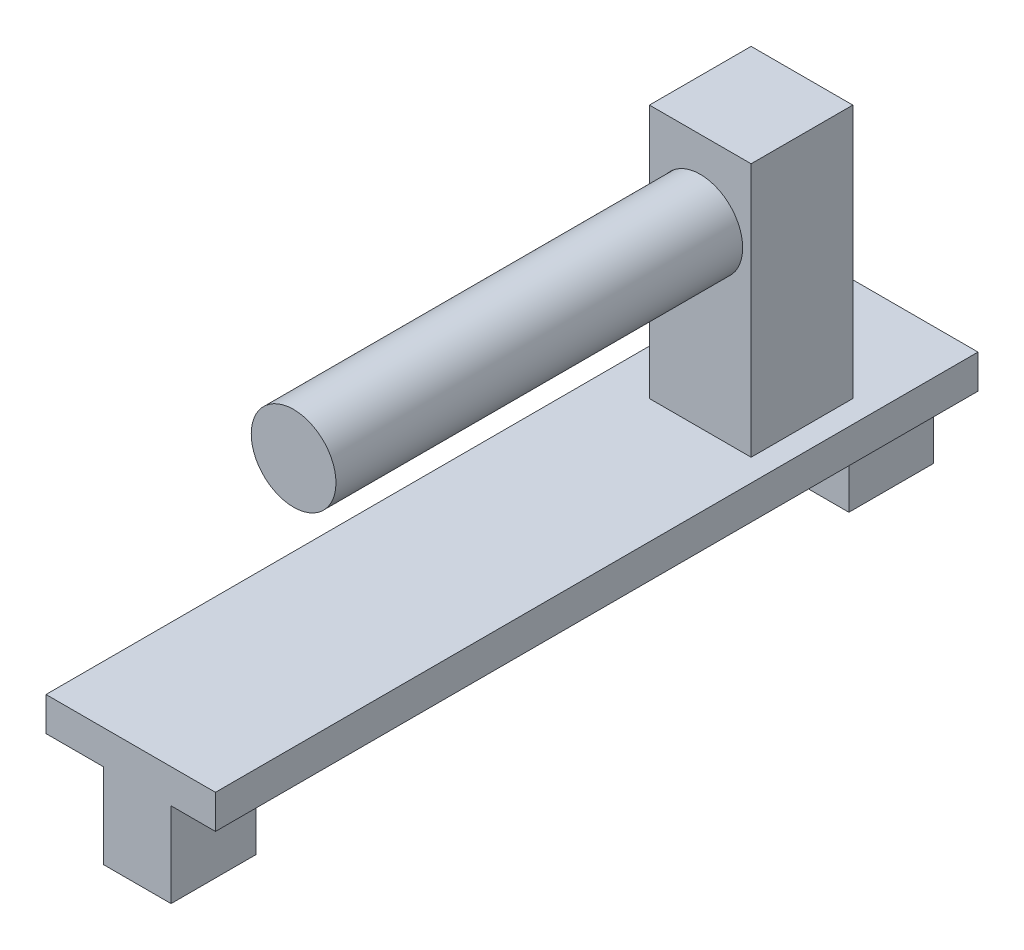
ISO-10303-21;
HEADER;
FILE_DESCRIPTION(('STEP AP214'),'2;1');
FILE_NAME('part.step','',(''),(''),'','','');
FILE_SCHEMA(('AUTOMOTIVE_DESIGN { 1 0 10303 214 1 1 1 1 }'));
ENDSEC;
DATA;
#1=APPLICATION_CONTEXT('core data for automotive mechanical design processes');
#2=APPLICATION_PROTOCOL_DEFINITION('international standard','automotive_design',2000,#1);
#3=PRODUCT_CONTEXT('',#1,'mechanical');
#4=PRODUCT('Part','Part','',(#3));
#5=PRODUCT_RELATED_PRODUCT_CATEGORY('part','',(#4));
#6=PRODUCT_DEFINITION_FORMATION('','',#4);
#7=PRODUCT_DEFINITION_CONTEXT('part definition',#1,'design');
#8=PRODUCT_DEFINITION('design','',#6,#7);
#9=PRODUCT_DEFINITION_SHAPE('','',#8);
#10=(LENGTH_UNIT() NAMED_UNIT(*) SI_UNIT(.MILLI.,.METRE.));
#11=(NAMED_UNIT(*) PLANE_ANGLE_UNIT() SI_UNIT($,.RADIAN.));
#12=(NAMED_UNIT(*) SI_UNIT($,.STERADIAN.) SOLID_ANGLE_UNIT());
#13=UNCERTAINTY_MEASURE_WITH_UNIT(LENGTH_MEASURE(1.E-05),#10,'distance_accuracy_value','');
#14=(GEOMETRIC_REPRESENTATION_CONTEXT(3) GLOBAL_UNCERTAINTY_ASSIGNED_CONTEXT((#13)) GLOBAL_UNIT_ASSIGNED_CONTEXT((#10,
#11,#12)) REPRESENTATION_CONTEXT('',''));
#15=CARTESIAN_POINT('',(0.,0.,0.));
#16=DIRECTION('',(0.,0.,1.));
#17=DIRECTION('',(1.,0.,0.));
#18=AXIS2_PLACEMENT_3D('',#15,#16,#17);
#19=CARTESIAN_POINT('',(-3.,15.,3.));
#20=DIRECTION('',(0.,0.,-1.));
#21=DIRECTION('',(-1.,0.,0.));
#22=AXIS2_PLACEMENT_3D('',#19,#20,#21);
#23=PLANE('',#22);
#24=DIRECTION('',(1.,0.,0.));
#25=VECTOR('',#24,1.);
#26=CARTESIAN_POINT('',(-3.,0.,3.));
#27=LINE('',#26,#25);
#28=CARTESIAN_POINT('',(-3.,0.,3.));
#29=VERTEX_POINT('',#28);
#30=CARTESIAN_POINT('',(3.,0.,3.));
#31=VERTEX_POINT('',#30);
#32=EDGE_CURVE('E350',#29,#31,#27,.T.);
#33=ORIENTED_EDGE('',*,*,#32,.T.);
#34=DIRECTION('',(0.,-1.,0.));
#35=VECTOR('',#34,1.);
#36=CARTESIAN_POINT('',(3.,15.,3.));
#37=LINE('',#36,#35);
#38=CARTESIAN_POINT('',(3.,15.,3.));
#39=VERTEX_POINT('',#38);
#40=EDGE_CURVE('E356',#39,#31,#37,.T.);
#41=ORIENTED_EDGE('',*,*,#40,.F.);
#42=DIRECTION('',(1.,0.,0.));
#43=VECTOR('',#42,1.);
#44=CARTESIAN_POINT('',(-3.,15.,3.));
#45=LINE('',#44,#43);
#46=CARTESIAN_POINT('',(-3.,15.,3.));
#47=VERTEX_POINT('',#46);
#48=EDGE_CURVE('E354',#47,#39,#45,.T.);
#49=ORIENTED_EDGE('',*,*,#48,.F.);
#50=DIRECTION('',(0.,-1.,0.));
#51=VECTOR('',#50,1.);
#52=CARTESIAN_POINT('',(-3.,15.,3.));
#53=LINE('',#52,#51);
#54=EDGE_CURVE('E369',#47,#29,#53,.T.);
#55=ORIENTED_EDGE('',*,*,#54,.T.);
#56=EDGE_LOOP('',(#33,#41,#49,#55));
#57=FACE_BOUND('',#56,.T.);
#58=CARTESIAN_POINT('',(0.,10.4452328602633,3.));
#59=DIRECTION('',(0.,0.,-1.));
#60=DIRECTION('',(-1.,0.,0.));
#61=AXIS2_PLACEMENT_3D('',#58,#59,#60);
#62=CIRCLE('',#61,2.5);
#63=CARTESIAN_POINT('',(-2.49998592310197,10.4536223949339,3.));
#64=VERTEX_POINT('',#63);
#65=CARTESIAN_POINT('',(2.49998592310197,10.4536223949339,3.));
#66=VERTEX_POINT('',#65);
#67=EDGE_CURVE('E198',#64,#66,#62,.F.);
#68=ORIENTED_EDGE('',*,*,#67,.F.);
#69=CARTESIAN_POINT('',(0.,10.4620119296044,3.));
#70=DIRECTION('',(0.,0.,1.));
#71=DIRECTION('',(1.,0.,0.));
#72=AXIS2_PLACEMENT_3D('',#69,#70,#71);
#73=CIRCLE('',#72,2.5);
#74=EDGE_CURVE('E197',#66,#64,#73,.T.);
#75=ORIENTED_EDGE('',*,*,#74,.F.);
#76=EDGE_LOOP('',(#68,#75));
#77=FACE_BOUND('',#76,.T.);
#78=ADVANCED_FACE('F33',(#57,#77),#23,.F.);
#79=CARTESIAN_POINT('',(0.,10.4620119296044,2.));
#80=DIRECTION('',(0.,0.,1.));
#81=DIRECTION('',(1.,0.,0.));
#82=AXIS2_PLACEMENT_3D('',#79,#80,#81);
#83=CYLINDRICAL_SURFACE('',#82,2.5);
#84=DIRECTION('',(0.,0.,-1.));
#85=VECTOR('',#84,1.);
#86=CARTESIAN_POINT('',(2.49998592310197,10.4536223949339,14.5));
#87=LINE('',#86,#85);
#88=CARTESIAN_POINT('',(2.49998592310197,10.4536223949339,2.));
#89=VERTEX_POINT('',#88);
#90=EDGE_CURVE('E50',#66,#89,#87,.T.);
#91=ORIENTED_EDGE('',*,*,#90,.F.);
#92=ORIENTED_EDGE('',*,*,#74,.T.);
#93=DIRECTION('',(0.,0.,-1.));
#94=VECTOR('',#93,1.);
#95=CARTESIAN_POINT('',(-2.49998592310197,10.4536223949339,14.5));
#96=LINE('',#95,#94);
#97=CARTESIAN_POINT('',(-2.49998592310197,10.4536223949339,2.));
#98=VERTEX_POINT('',#97);
#99=EDGE_CURVE('E185',#98,#64,#96,.F.);
#100=ORIENTED_EDGE('',*,*,#99,.F.);
#101=CARTESIAN_POINT('',(0.,10.4620119296044,2.));
#102=DIRECTION('',(0.,0.,1.));
#103=DIRECTION('',(1.,0.,0.));
#104=AXIS2_PLACEMENT_3D('',#101,#102,#103);
#105=CIRCLE('',#104,2.5);
#106=EDGE_CURVE('E195',#89,#98,#105,.T.);
#107=ORIENTED_EDGE('',*,*,#106,.F.);
#108=EDGE_LOOP('',(#91,#92,#100,#107));
#109=FACE_BOUND('',#108,.T.);
#110=ADVANCED_FACE('F194',(#109),#83,.F.);
#111=CARTESIAN_POINT('',(0.,10.4620119296044,2.));
#112=DIRECTION('',(0.,0.,1.));
#113=DIRECTION('',(1.,0.,0.));
#114=AXIS2_PLACEMENT_3D('',#111,#112,#113);
#115=PLANE('',#114);
#116=ORIENTED_EDGE('',*,*,#106,.T.);
#117=CARTESIAN_POINT('',(0.,10.4452328602633,2.));
#118=DIRECTION('',(0.,0.,1.));
#119=DIRECTION('',(1.,0.,0.));
#120=AXIS2_PLACEMENT_3D('',#117,#118,#119);
#121=CIRCLE('',#120,2.5);
#122=EDGE_CURVE('E182',#89,#98,#121,.T.);
#123=ORIENTED_EDGE('',*,*,#122,.F.);
#124=EDGE_LOOP('',(#116,#123));
#125=FACE_BOUND('',#124,.T.);
#126=ADVANCED_FACE('F200',(#125),#115,.T.);
#127=CARTESIAN_POINT('',(0.,0.,-7.0712800267579));
#128=DIRECTION('',(0.,0.,-1.));
#129=DIRECTION('',(-1.,0.,0.));
#130=AXIS2_PLACEMENT_3D('',#127,#128,#129);
#131=PLANE('',#130);
#132=DIRECTION('',(-1.,0.,0.));
#133=VECTOR('',#132,1.);
#134=CARTESIAN_POINT('',(1.69782054790448,-4.,-7.0712800267579));
#135=LINE('',#134,#133);
#136=CARTESIAN_POINT('',(1.69782054790448,-4.,-7.0712800267579));
#137=VERTEX_POINT('',#136);
#138=CARTESIAN_POINT('',(-2.30217945209552,-4.,-7.0712800267579));
#139=VERTEX_POINT('',#138);
#140=EDGE_CURVE('E201',#137,#139,#135,.T.);
#141=ORIENTED_EDGE('',*,*,#140,.F.);
#142=DIRECTION('',(0.,-1.,0.));
#143=VECTOR('',#142,1.);
#144=CARTESIAN_POINT('',(1.69782054790448,-2.,-7.0712800267579));
#145=LINE('',#144,#143);
#146=CARTESIAN_POINT('',(1.69782054790448,-2.,-7.0712800267579));
#147=VERTEX_POINT('',#146);
#148=EDGE_CURVE('E242',#147,#137,#145,.T.);
#149=ORIENTED_EDGE('',*,*,#148,.F.);
#150=DIRECTION('',(1.,0.,0.));
#151=VECTOR('',#150,1.);
#152=CARTESIAN_POINT('',(1.69782054790448,-2.,-7.0712800267579));
#153=LINE('',#152,#151);
#154=CARTESIAN_POINT('',(-2.30217945209552,-2.,-7.0712800267579));
#155=VERTEX_POINT('',#154);
#156=EDGE_CURVE('E248',#155,#147,#153,.T.);
#157=ORIENTED_EDGE('',*,*,#156,.F.);
#158=DIRECTION('',(0.,1.,0.));
#159=VECTOR('',#158,1.);
#160=CARTESIAN_POINT('',(-2.30217945209552,-2.,-7.0712800267579));
#161=LINE('',#160,#159);
#162=EDGE_CURVE('E245',#139,#155,#161,.T.);
#163=ORIENTED_EDGE('',*,*,#162,.F.);
#164=EDGE_LOOP('',(#141,#149,#157,#163));
#165=FACE_BOUND('',#164,.T.);
#166=ADVANCED_FACE('F418',(#165),#131,.F.);
#167=CARTESIAN_POINT('',(0.,0.,33.9287199732421));
#168=DIRECTION('',(0.,0.,1.));
#169=DIRECTION('',(1.,0.,0.));
#170=AXIS2_PLACEMENT_3D('',#167,#168,#169);
#171=PLANE('',#170);
#172=DIRECTION('',(1.,0.,0.));
#173=VECTOR('',#172,1.);
#174=CARTESIAN_POINT('',(1.69782054790449,-4.,33.9287199732421));
#175=LINE('',#174,#173);
#176=CARTESIAN_POINT('',(-2.30217945209552,-4.,33.9287199732421));
#177=VERTEX_POINT('',#176);
#178=CARTESIAN_POINT('',(1.69782054790449,-4.,33.9287199732421));
#179=VERTEX_POINT('',#178);
#180=EDGE_CURVE('E58',#177,#179,#175,.T.);
#181=ORIENTED_EDGE('',*,*,#180,.F.);
#182=DIRECTION('',(0.,-1.,0.));
#183=VECTOR('',#182,1.);
#184=CARTESIAN_POINT('',(-2.30217945209552,-2.,33.9287199732421));
#185=LINE('',#184,#183);
#186=CARTESIAN_POINT('',(-2.30217945209552,-2.,33.9287199732421));
#187=VERTEX_POINT('',#186);
#188=EDGE_CURVE('E268',#187,#177,#185,.T.);
#189=ORIENTED_EDGE('',*,*,#188,.F.);
#190=DIRECTION('',(-1.,0.,0.));
#191=VECTOR('',#190,1.);
#192=CARTESIAN_POINT('',(-2.30217945209552,-2.,33.9287199732421));
#193=LINE('',#192,#191);
#194=CARTESIAN_POINT('',(1.69782054790448,-2.,33.9287199732421));
#195=VERTEX_POINT('',#194);
#196=EDGE_CURVE('E273',#195,#187,#193,.T.);
#197=ORIENTED_EDGE('',*,*,#196,.F.);
#198=DIRECTION('',(0.,1.,0.));
#199=VECTOR('',#198,1.);
#200=CARTESIAN_POINT('',(1.69782054790448,-2.,33.9287199732421));
#201=LINE('',#200,#199);
#202=EDGE_CURVE('E270',#179,#195,#201,.T.);
#203=ORIENTED_EDGE('',*,*,#202,.F.);
#204=EDGE_LOOP('',(#181,#189,#197,#203));
#205=FACE_BOUND('',#204,.T.);
#206=ADVANCED_FACE('F414',(#205),#171,.F.);
#207=CARTESIAN_POINT('',(3.,15.,3.));
#208=DIRECTION('',(-1.,0.,0.));
#209=DIRECTION('',(0.,0.,1.));
#210=AXIS2_PLACEMENT_3D('',#207,#208,#209);
#211=PLANE('',#210);
#212=DIRECTION('',(0.,0.,-1.));
#213=VECTOR('',#212,1.);
#214=CARTESIAN_POINT('',(3.,0.,3.));
#215=LINE('',#214,#213);
#216=CARTESIAN_POINT('',(3.,0.,-3.));
#217=VERTEX_POINT('',#216);
#218=EDGE_CURVE('E340',#31,#217,#215,.T.);
#219=ORIENTED_EDGE('',*,*,#218,.T.);
#220=DIRECTION('',(0.,-1.,0.));
#221=VECTOR('',#220,1.);
#222=CARTESIAN_POINT('',(3.,15.,-3.));
#223=LINE('',#222,#221);
#224=CARTESIAN_POINT('',(3.,15.,-3.));
#225=VERTEX_POINT('',#224);
#226=EDGE_CURVE('E11',#225,#217,#223,.T.);
#227=ORIENTED_EDGE('',*,*,#226,.F.);
#228=DIRECTION('',(0.,0.,-1.));
#229=VECTOR('',#228,1.);
#230=CARTESIAN_POINT('',(3.,15.,3.));
#231=LINE('',#230,#229);
#232=EDGE_CURVE('E346',#39,#225,#231,.T.);
#233=ORIENTED_EDGE('',*,*,#232,.F.);
#234=ORIENTED_EDGE('',*,*,#40,.T.);
#235=EDGE_LOOP('',(#219,#227,#233,#234));
#236=FACE_BOUND('',#235,.T.);
#237=ADVANCED_FACE('F35',(#236),#211,.F.);
#238=CARTESIAN_POINT('',(-3.,15.,-3.));
#239=DIRECTION('',(0.,0.,1.));
#240=DIRECTION('',(1.,0.,0.));
#241=AXIS2_PLACEMENT_3D('',#238,#239,#240);
#242=PLANE('',#241);
#243=DIRECTION('',(-1.,0.,0.));
#244=VECTOR('',#243,1.);
#245=CARTESIAN_POINT('',(-3.,0.,-3.));
#246=LINE('',#245,#244);
#247=CARTESIAN_POINT('',(-3.,0.,-3.));
#248=VERTEX_POINT('',#247);
#249=EDGE_CURVE('E359',#217,#248,#246,.T.);
#250=ORIENTED_EDGE('',*,*,#249,.T.);
#251=DIRECTION('',(0.,-1.,0.));
#252=VECTOR('',#251,1.);
#253=CARTESIAN_POINT('',(-3.,15.,-3.));
#254=LINE('',#253,#252);
#255=CARTESIAN_POINT('',(-3.,15.,-3.));
#256=VERTEX_POINT('',#255);
#257=EDGE_CURVE('E42',#256,#248,#254,.T.);
#258=ORIENTED_EDGE('',*,*,#257,.F.);
#259=DIRECTION('',(-1.,0.,0.));
#260=VECTOR('',#259,1.);
#261=CARTESIAN_POINT('',(-3.,15.,-3.));
#262=LINE('',#261,#260);
#263=EDGE_CURVE('E349',#225,#256,#262,.T.);
#264=ORIENTED_EDGE('',*,*,#263,.F.);
#265=ORIENTED_EDGE('',*,*,#226,.T.);
#266=EDGE_LOOP('',(#250,#258,#264,#265));
#267=FACE_BOUND('',#266,.T.);
#268=ADVANCED_FACE('F379',(#267),#242,.F.);
#269=CARTESIAN_POINT('',(-3.,15.,3.));
#270=DIRECTION('',(1.,0.,0.));
#271=DIRECTION('',(0.,0.,-1.));
#272=AXIS2_PLACEMENT_3D('',#269,#270,#271);
#273=PLANE('',#272);
#274=DIRECTION('',(0.,0.,1.));
#275=VECTOR('',#274,1.);
#276=CARTESIAN_POINT('',(-3.,0.,3.));
#277=LINE('',#276,#275);
#278=EDGE_CURVE('E362',#248,#29,#277,.T.);
#279=ORIENTED_EDGE('',*,*,#278,.T.);
#280=ORIENTED_EDGE('',*,*,#54,.F.);
#281=DIRECTION('',(0.,0.,1.));
#282=VECTOR('',#281,1.);
#283=CARTESIAN_POINT('',(-3.,15.,3.));
#284=LINE('',#283,#282);
#285=EDGE_CURVE('E352',#256,#47,#284,.T.);
#286=ORIENTED_EDGE('',*,*,#285,.F.);
#287=ORIENTED_EDGE('',*,*,#257,.T.);
#288=EDGE_LOOP('',(#279,#280,#286,#287));
#289=FACE_BOUND('',#288,.T.);
#290=ADVANCED_FACE('F376',(#289),#273,.F.);
#291=CARTESIAN_POINT('',(0.,15.,0.));
#292=DIRECTION('',(0.,-1.,0.));
#293=DIRECTION('',(0.,0.,-1.));
#294=AXIS2_PLACEMENT_3D('',#291,#292,#293);
#295=PLANE('',#294);
#296=ORIENTED_EDGE('',*,*,#232,.T.);
#297=ORIENTED_EDGE('',*,*,#263,.T.);
#298=ORIENTED_EDGE('',*,*,#285,.T.);
#299=ORIENTED_EDGE('',*,*,#48,.T.);
#300=EDGE_LOOP('',(#296,#297,#298,#299));
#301=FACE_BOUND('',#300,.T.);
#302=ADVANCED_FACE('F390',(#301),#295,.F.);
#303=CARTESIAN_POINT('',(0.,0.,0.));
#304=DIRECTION('',(0.,-1.,0.));
#305=DIRECTION('',(0.,0.,-1.));
#306=AXIS2_PLACEMENT_3D('',#303,#304,#305);
#307=PLANE('',#306);
#308=DIRECTION('',(0.,0.,-1.));
#309=VECTOR('',#308,1.);
#310=CARTESIAN_POINT('',(4.31759311067933,0.,-9.0712800267579));
#311=LINE('',#310,#309);
#312=CARTESIAN_POINT('',(4.31759311067934,0.,35.9287199732421));
#313=VERTEX_POINT('',#312);
#314=CARTESIAN_POINT('',(4.31759311067933,0.,-9.0712800267579));
#315=VERTEX_POINT('',#314);
#316=EDGE_CURVE('E289',#313,#315,#311,.T.);
#317=ORIENTED_EDGE('',*,*,#316,.T.);
#318=DIRECTION('',(-1.,0.,0.));
#319=VECTOR('',#318,1.);
#320=CARTESIAN_POINT('',(4.31759311067933,0.,-9.0712800267579));
#321=LINE('',#320,#319);
#322=CARTESIAN_POINT('',(-5.68240688932066,0.,-9.0712800267579));
#323=VERTEX_POINT('',#322);
#324=EDGE_CURVE('E329',#315,#323,#321,.T.);
#325=ORIENTED_EDGE('',*,*,#324,.T.);
#326=DIRECTION('',(0.,0.,1.));
#327=VECTOR('',#326,1.);
#328=CARTESIAN_POINT('',(-5.68240688932066,0.,-9.0712800267579));
#329=LINE('',#328,#327);
#330=CARTESIAN_POINT('',(-5.68240688932066,0.,35.9287199732421));
#331=VERTEX_POINT('',#330);
#332=EDGE_CURVE('E332',#323,#331,#329,.T.);
#333=ORIENTED_EDGE('',*,*,#332,.T.);
#334=DIRECTION('',(1.,0.,0.));
#335=VECTOR('',#334,1.);
#336=CARTESIAN_POINT('',(4.31759311067934,0.,35.9287199732421));
#337=LINE('',#336,#335);
#338=EDGE_CURVE('E335',#331,#313,#337,.T.);
#339=ORIENTED_EDGE('',*,*,#338,.T.);
#340=EDGE_LOOP('',(#317,#325,#333,#339));
#341=FACE_BOUND('',#340,.T.);
#342=ORIENTED_EDGE('',*,*,#249,.F.);
#343=ORIENTED_EDGE('',*,*,#218,.F.);
#344=ORIENTED_EDGE('',*,*,#32,.F.);
#345=ORIENTED_EDGE('',*,*,#278,.F.);
#346=EDGE_LOOP('',(#342,#343,#344,#345));
#347=FACE_BOUND('',#346,.T.);
#348=ADVANCED_FACE('F382',(#341,#347),#307,.F.);
#349=CARTESIAN_POINT('',(4.31759311067933,-2.,-9.0712800267579));
#350=DIRECTION('',(1.,0.,0.));
#351=DIRECTION('',(0.,0.,-1.));
#352=AXIS2_PLACEMENT_3D('',#349,#350,#351);
#353=PLANE('',#352);
#354=ORIENTED_EDGE('',*,*,#316,.F.);
#355=DIRECTION('',(0.,1.,0.));
#356=VECTOR('',#355,1.);
#357=CARTESIAN_POINT('',(4.31759311067934,-2.,35.9287199732421));
#358=LINE('',#357,#356);
#359=CARTESIAN_POINT('',(4.31759311067934,-2.,35.9287199732421));
#360=VERTEX_POINT('',#359);
#361=EDGE_CURVE('E338',#360,#313,#358,.T.);
#362=ORIENTED_EDGE('',*,*,#361,.F.);
#363=DIRECTION('',(0.,0.,-1.));
#364=VECTOR('',#363,1.);
#365=CARTESIAN_POINT('',(4.31759311067933,-2.,-9.0712800267579));
#366=LINE('',#365,#364);
#367=CARTESIAN_POINT('',(4.31759311067933,-2.,-9.0712800267579));
#368=VERTEX_POINT('',#367);
#369=EDGE_CURVE('E312',#360,#368,#366,.T.);
#370=ORIENTED_EDGE('',*,*,#369,.T.);
#371=DIRECTION('',(0.,1.,0.));
#372=VECTOR('',#371,1.);
#373=CARTESIAN_POINT('',(4.31759311067933,-2.,-9.0712800267579));
#374=LINE('',#373,#372);
#375=EDGE_CURVE('E317',#368,#315,#374,.T.);
#376=ORIENTED_EDGE('',*,*,#375,.T.);
#377=EDGE_LOOP('',(#354,#362,#370,#376));
#378=FACE_BOUND('',#377,.T.);
#379=ADVANCED_FACE('F397',(#378),#353,.T.);
#380=CARTESIAN_POINT('',(4.31759311067934,-2.,35.9287199732421));
#381=DIRECTION('',(0.,0.,1.));
#382=DIRECTION('',(1.,0.,0.));
#383=AXIS2_PLACEMENT_3D('',#380,#381,#382);
#384=PLANE('',#383);
#385=ORIENTED_EDGE('',*,*,#338,.F.);
#386=DIRECTION('',(0.,1.,0.));
#387=VECTOR('',#386,1.);
#388=CARTESIAN_POINT('',(-5.68240688932066,-2.,35.9287199732421));
#389=LINE('',#388,#387);
#390=CARTESIAN_POINT('',(-5.68240688932066,-2.,35.9287199732421));
#391=VERTEX_POINT('',#390);
#392=EDGE_CURVE('E341',#391,#331,#389,.T.);
#393=ORIENTED_EDGE('',*,*,#392,.F.);
#394=DIRECTION('',(1.,0.,0.));
#395=VECTOR('',#394,1.);
#396=CARTESIAN_POINT('',(4.31759311067934,-2.,35.9287199732421));
#397=LINE('',#396,#395);
#398=CARTESIAN_POINT('',(-2.30217945209552,-2.,35.9287199732421));
#399=VERTEX_POINT('',#398);
#400=EDGE_CURVE('E313',#391,#399,#397,.T.);
#401=ORIENTED_EDGE('',*,*,#400,.T.);
#402=DIRECTION('',(0.,-1.,0.));
#403=VECTOR('',#402,1.);
#404=CARTESIAN_POINT('',(-2.30217945209552,-2.,35.9287199732421));
#405=LINE('',#404,#403);
#406=CARTESIAN_POINT('',(-2.30217945209551,-7.,35.9287199732421));
#407=VERTEX_POINT('',#406);
#408=EDGE_CURVE('E261',#399,#407,#405,.T.);
#409=ORIENTED_EDGE('',*,*,#408,.T.);
#410=DIRECTION('',(1.,0.,0.));
#411=VECTOR('',#410,1.);
#412=CARTESIAN_POINT('',(-2.30217945209551,-7.,35.9287199732421));
#413=LINE('',#412,#411);
#414=CARTESIAN_POINT('',(1.69782054790449,-7.,35.9287199732421));
#415=VERTEX_POINT('',#414);
#416=EDGE_CURVE('E277',#407,#415,#413,.T.);
#417=ORIENTED_EDGE('',*,*,#416,.T.);
#418=DIRECTION('',(0.,1.,0.));
#419=VECTOR('',#418,1.);
#420=CARTESIAN_POINT('',(1.69782054790448,-2.,35.9287199732421));
#421=LINE('',#420,#419);
#422=CARTESIAN_POINT('',(1.69782054790448,-2.,35.9287199732421));
#423=VERTEX_POINT('',#422);
#424=EDGE_CURVE('E271',#415,#423,#421,.T.);
#425=ORIENTED_EDGE('',*,*,#424,.T.);
#426=EDGE_CURVE('E301',#423,#360,#397,.T.);
#427=ORIENTED_EDGE('',*,*,#426,.T.);
#428=ORIENTED_EDGE('',*,*,#361,.T.);
#429=EDGE_LOOP('',(#385,#393,#401,#409,#417,#425,#427,#428));
#430=FACE_BOUND('',#429,.T.);
#431=ADVANCED_FACE('F300',(#430),#384,.T.);
#432=CARTESIAN_POINT('',(-5.68240688932066,-2.,-9.0712800267579));
#433=DIRECTION('',(-1.,0.,0.));
#434=DIRECTION('',(0.,0.,1.));
#435=AXIS2_PLACEMENT_3D('',#432,#433,#434);
#436=PLANE('',#435);
#437=ORIENTED_EDGE('',*,*,#332,.F.);
#438=DIRECTION('',(0.,1.,0.));
#439=VECTOR('',#438,1.);
#440=CARTESIAN_POINT('',(-5.68240688932066,-2.,-9.0712800267579));
#441=LINE('',#440,#439);
#442=CARTESIAN_POINT('',(-5.68240688932066,-2.,-9.0712800267579));
#443=VERTEX_POINT('',#442);
#444=EDGE_CURVE('E343',#443,#323,#441,.T.);
#445=ORIENTED_EDGE('',*,*,#444,.F.);
#446=DIRECTION('',(0.,0.,1.));
#447=VECTOR('',#446,1.);
#448=CARTESIAN_POINT('',(-5.68240688932066,-2.,-9.0712800267579));
#449=LINE('',#448,#447);
#450=EDGE_CURVE('E314',#443,#391,#449,.T.);
#451=ORIENTED_EDGE('',*,*,#450,.T.);
#452=ORIENTED_EDGE('',*,*,#392,.T.);
#453=EDGE_LOOP('',(#437,#445,#451,#452));
#454=FACE_BOUND('',#453,.T.);
#455=ADVANCED_FACE('F446',(#454),#436,.T.);
#456=CARTESIAN_POINT('',(4.31759311067933,-2.,-9.0712800267579));
#457=DIRECTION('',(0.,0.,-1.));
#458=DIRECTION('',(-1.,0.,0.));
#459=AXIS2_PLACEMENT_3D('',#456,#457,#458);
#460=PLANE('',#459);
#461=ORIENTED_EDGE('',*,*,#324,.F.);
#462=ORIENTED_EDGE('',*,*,#375,.F.);
#463=DIRECTION('',(-1.,0.,0.));
#464=VECTOR('',#463,1.);
#465=CARTESIAN_POINT('',(4.31759311067933,-2.,-9.0712800267579));
#466=LINE('',#465,#464);
#467=CARTESIAN_POINT('',(1.69782054790448,-2.,-9.0712800267579));
#468=VERTEX_POINT('',#467);
#469=EDGE_CURVE('E320',#368,#468,#466,.T.);
#470=ORIENTED_EDGE('',*,*,#469,.T.);
#471=DIRECTION('',(0.,-1.,0.));
#472=VECTOR('',#471,1.);
#473=CARTESIAN_POINT('',(1.69782054790448,-2.,-9.0712800267579));
#474=LINE('',#473,#472);
#475=CARTESIAN_POINT('',(1.69782054790448,-7.,-9.0712800267579));
#476=VERTEX_POINT('',#475);
#477=EDGE_CURVE('E241',#468,#476,#474,.T.);
#478=ORIENTED_EDGE('',*,*,#477,.T.);
#479=DIRECTION('',(-1.,0.,0.));
#480=VECTOR('',#479,1.);
#481=CARTESIAN_POINT('',(1.69782054790448,-7.,-9.0712800267579));
#482=LINE('',#481,#480);
#483=CARTESIAN_POINT('',(-2.30217945209552,-7.,-9.0712800267579));
#484=VERTEX_POINT('',#483);
#485=EDGE_CURVE('E254',#476,#484,#482,.T.);
#486=ORIENTED_EDGE('',*,*,#485,.T.);
#487=DIRECTION('',(0.,1.,0.));
#488=VECTOR('',#487,1.);
#489=CARTESIAN_POINT('',(-2.30217945209552,-2.,-9.0712800267579));
#490=LINE('',#489,#488);
#491=CARTESIAN_POINT('',(-2.30217945209552,-2.,-9.0712800267579));
#492=VERTEX_POINT('',#491);
#493=EDGE_CURVE('E246',#484,#492,#490,.T.);
#494=ORIENTED_EDGE('',*,*,#493,.T.);
#495=EDGE_CURVE('E475',#492,#443,#466,.T.);
#496=ORIENTED_EDGE('',*,*,#495,.T.);
#497=ORIENTED_EDGE('',*,*,#444,.T.);
#498=EDGE_LOOP('',(#461,#462,#470,#478,#486,#494,#496,#497));
#499=FACE_BOUND('',#498,.T.);
#500=ADVANCED_FACE('F442',(#499),#460,.T.);
#501=CARTESIAN_POINT('',(0.,-2.,0.));
#502=DIRECTION('',(0.,-1.,0.));
#503=DIRECTION('',(0.,0.,-1.));
#504=AXIS2_PLACEMENT_3D('',#501,#502,#503);
#505=PLANE('',#504);
#506=DIRECTION('',(0.,0.,-1.));
#507=VECTOR('',#506,1.);
#508=CARTESIAN_POINT('',(1.69782054790448,-2.,-7.0712800267579));
#509=LINE('',#508,#507);
#510=EDGE_CURVE('E258',#147,#468,#509,.T.);
#511=ORIENTED_EDGE('',*,*,#510,.T.);
#512=ORIENTED_EDGE('',*,*,#469,.F.);
#513=ORIENTED_EDGE('',*,*,#369,.F.);
#514=ORIENTED_EDGE('',*,*,#426,.F.);
#515=DIRECTION('',(0.,0.,1.));
#516=VECTOR('',#515,1.);
#517=CARTESIAN_POINT('',(1.69782054790448,-2.,33.9287199732421));
#518=LINE('',#517,#516);
#519=EDGE_CURVE('E290',#195,#423,#518,.T.);
#520=ORIENTED_EDGE('',*,*,#519,.F.);
#521=ORIENTED_EDGE('',*,*,#196,.T.);
#522=DIRECTION('',(0.,0.,1.));
#523=VECTOR('',#522,1.);
#524=CARTESIAN_POINT('',(-2.30217945209552,-2.,33.9287199732421));
#525=LINE('',#524,#523);
#526=EDGE_CURVE('E285',#187,#399,#525,.T.);
#527=ORIENTED_EDGE('',*,*,#526,.T.);
#528=ORIENTED_EDGE('',*,*,#400,.F.);
#529=ORIENTED_EDGE('',*,*,#450,.F.);
#530=ORIENTED_EDGE('',*,*,#495,.F.);
#531=DIRECTION('',(0.,0.,-1.));
#532=VECTOR('',#531,1.);
#533=CARTESIAN_POINT('',(-2.30217945209552,-2.,-7.0712800267579));
#534=LINE('',#533,#532);
#535=EDGE_CURVE('E262',#155,#492,#534,.T.);
#536=ORIENTED_EDGE('',*,*,#535,.F.);
#537=ORIENTED_EDGE('',*,*,#156,.T.);
#538=EDGE_LOOP('',(#511,#512,#513,#514,#520,#521,#527,#528,#529,#530,#536,#537));
#539=FACE_BOUND('',#538,.T.);
#540=ADVANCED_FACE('F309',(#539),#505,.T.);
#541=CARTESIAN_POINT('',(-2.30217945209552,-2.,33.9287199732421));
#542=DIRECTION('',(-1.,0.,0.));
#543=DIRECTION('',(0.,-1.,0.));
#544=AXIS2_PLACEMENT_3D('',#541,#542,#543);
#545=PLANE('',#544);
#546=ORIENTED_EDGE('',*,*,#408,.F.);
#547=ORIENTED_EDGE('',*,*,#526,.F.);
#548=ORIENTED_EDGE('',*,*,#188,.T.);
#549=DIRECTION('',(0.,0.,1.));
#550=VECTOR('',#549,1.);
#551=CARTESIAN_POINT('',(-2.30217945209551,-4.,30.9287199732421));
#552=LINE('',#551,#550);
#553=CARTESIAN_POINT('',(-2.30217945209551,-4.,30.9287199732421));
#554=VERTEX_POINT('',#553);
#555=EDGE_CURVE('E238',#554,#177,#552,.T.);
#556=ORIENTED_EDGE('',*,*,#555,.F.);
#557=DIRECTION('',(0.,1.,0.));
#558=VECTOR('',#557,1.);
#559=CARTESIAN_POINT('',(-2.30217945209551,-7.,30.9287199732421));
#560=LINE('',#559,#558);
#561=CARTESIAN_POINT('',(-2.30217945209551,-7.,30.9287199732421));
#562=VERTEX_POINT('',#561);
#563=EDGE_CURVE('E230',#562,#554,#560,.T.);
#564=ORIENTED_EDGE('',*,*,#563,.F.);
#565=DIRECTION('',(0.,0.,1.));
#566=VECTOR('',#565,1.);
#567=CARTESIAN_POINT('',(-2.30217945209551,-7.,33.9287199732421));
#568=LINE('',#567,#566);
#569=EDGE_CURVE('E276',#562,#407,#568,.T.);
#570=ORIENTED_EDGE('',*,*,#569,.T.);
#571=EDGE_LOOP('',(#546,#547,#548,#556,#564,#570));
#572=FACE_BOUND('',#571,.T.);
#573=ADVANCED_FACE('F435',(#572),#545,.T.);
#574=CARTESIAN_POINT('',(1.69782054790448,-2.,33.9287199732421));
#575=DIRECTION('',(1.,0.,0.));
#576=DIRECTION('',(0.,1.,0.));
#577=AXIS2_PLACEMENT_3D('',#574,#575,#576);
#578=PLANE('',#577);
#579=ORIENTED_EDGE('',*,*,#424,.F.);
#580=DIRECTION('',(0.,0.,1.));
#581=VECTOR('',#580,1.);
#582=CARTESIAN_POINT('',(1.69782054790449,-7.,33.9287199732421));
#583=LINE('',#582,#581);
#584=CARTESIAN_POINT('',(1.69782054790449,-7.,30.9287199732421));
#585=VERTEX_POINT('',#584);
#586=EDGE_CURVE('E282',#585,#415,#583,.T.);
#587=ORIENTED_EDGE('',*,*,#586,.F.);
#588=DIRECTION('',(0.,-1.,0.));
#589=VECTOR('',#588,1.);
#590=CARTESIAN_POINT('',(1.69782054790449,-7.,30.9287199732421));
#591=LINE('',#590,#589);
#592=CARTESIAN_POINT('',(1.69782054790449,-4.,30.9287199732421));
#593=VERTEX_POINT('',#592);
#594=EDGE_CURVE('E224',#593,#585,#591,.T.);
#595=ORIENTED_EDGE('',*,*,#594,.F.);
#596=DIRECTION('',(0.,0.,1.));
#597=VECTOR('',#596,1.);
#598=CARTESIAN_POINT('',(1.69782054790449,-4.,30.9287199732421));
#599=LINE('',#598,#597);
#600=EDGE_CURVE('E234',#593,#179,#599,.T.);
#601=ORIENTED_EDGE('',*,*,#600,.T.);
#602=ORIENTED_EDGE('',*,*,#202,.T.);
#603=ORIENTED_EDGE('',*,*,#519,.T.);
#604=EDGE_LOOP('',(#579,#587,#595,#601,#602,#603));
#605=FACE_BOUND('',#604,.T.);
#606=ADVANCED_FACE('F431',(#605),#578,.T.);
#607=CARTESIAN_POINT('',(-2.30217945209551,-7.,33.9287199732421));
#608=DIRECTION('',(0.,-1.,0.));
#609=DIRECTION('',(0.,0.,-1.));
#610=AXIS2_PLACEMENT_3D('',#607,#608,#609);
#611=PLANE('',#610);
#612=ORIENTED_EDGE('',*,*,#416,.F.);
#613=ORIENTED_EDGE('',*,*,#569,.F.);
#614=DIRECTION('',(-1.,0.,0.));
#615=VECTOR('',#614,1.);
#616=CARTESIAN_POINT('',(1.69782054790449,-7.,30.9287199732421));
#617=LINE('',#616,#615);
#618=EDGE_CURVE('E227',#585,#562,#617,.T.);
#619=ORIENTED_EDGE('',*,*,#618,.F.);
#620=ORIENTED_EDGE('',*,*,#586,.T.);
#621=EDGE_LOOP('',(#612,#613,#619,#620));
#622=FACE_BOUND('',#621,.T.);
#623=ADVANCED_FACE('F434',(#622),#611,.T.);
#624=CARTESIAN_POINT('',(1.69782054790448,-2.,-7.0712800267579));
#625=DIRECTION('',(1.,0.,0.));
#626=DIRECTION('',(0.,1.,0.));
#627=AXIS2_PLACEMENT_3D('',#624,#625,#626);
#628=PLANE('',#627);
#629=ORIENTED_EDGE('',*,*,#477,.F.);
#630=ORIENTED_EDGE('',*,*,#510,.F.);
#631=ORIENTED_EDGE('',*,*,#148,.T.);
#632=DIRECTION('',(0.,0.,-1.));
#633=VECTOR('',#632,1.);
#634=CARTESIAN_POINT('',(1.69782054790448,-4.,-4.0712800267579));
#635=LINE('',#634,#633);
#636=CARTESIAN_POINT('',(1.69782054790448,-4.,-4.0712800267579));
#637=VERTEX_POINT('',#636);
#638=EDGE_CURVE('E222',#637,#137,#635,.T.);
#639=ORIENTED_EDGE('',*,*,#638,.F.);
#640=DIRECTION('',(0.,1.,0.));
#641=VECTOR('',#640,1.);
#642=CARTESIAN_POINT('',(1.69782054790448,-7.,-4.0712800267579));
#643=LINE('',#642,#641);
#644=CARTESIAN_POINT('',(1.69782054790448,-7.,-4.0712800267579));
#645=VERTEX_POINT('',#644);
#646=EDGE_CURVE('E203',#645,#637,#643,.T.);
#647=ORIENTED_EDGE('',*,*,#646,.F.);
#648=DIRECTION('',(0.,0.,-1.));
#649=VECTOR('',#648,1.);
#650=CARTESIAN_POINT('',(1.69782054790448,-7.,-7.0712800267579));
#651=LINE('',#650,#649);
#652=EDGE_CURVE('E251',#645,#476,#651,.T.);
#653=ORIENTED_EDGE('',*,*,#652,.T.);
#654=EDGE_LOOP('',(#629,#630,#631,#639,#647,#653));
#655=FACE_BOUND('',#654,.T.);
#656=ADVANCED_FACE('F429',(#655),#628,.T.);
#657=CARTESIAN_POINT('',(-2.30217945209552,-2.,-7.0712800267579));
#658=DIRECTION('',(-1.,0.,0.));
#659=DIRECTION('',(0.,-1.,0.));
#660=AXIS2_PLACEMENT_3D('',#657,#658,#659);
#661=PLANE('',#660);
#662=ORIENTED_EDGE('',*,*,#493,.F.);
#663=DIRECTION('',(0.,0.,-1.));
#664=VECTOR('',#663,1.);
#665=CARTESIAN_POINT('',(-2.30217945209552,-7.,-7.0712800267579));
#666=LINE('',#665,#664);
#667=CARTESIAN_POINT('',(-2.30217945209552,-7.,-4.0712800267579));
#668=VERTEX_POINT('',#667);
#669=EDGE_CURVE('E265',#668,#484,#666,.T.);
#670=ORIENTED_EDGE('',*,*,#669,.F.);
#671=DIRECTION('',(0.,-1.,0.));
#672=VECTOR('',#671,1.);
#673=CARTESIAN_POINT('',(-2.30217945209552,-7.,-4.0712800267579));
#674=LINE('',#673,#672);
#675=CARTESIAN_POINT('',(-2.30217945209552,-4.,-4.0712800267579));
#676=VERTEX_POINT('',#675);
#677=EDGE_CURVE('E213',#676,#668,#674,.T.);
#678=ORIENTED_EDGE('',*,*,#677,.F.);
#679=DIRECTION('',(0.,0.,-1.));
#680=VECTOR('',#679,1.);
#681=CARTESIAN_POINT('',(-2.30217945209552,-4.,-4.0712800267579));
#682=LINE('',#681,#680);
#683=EDGE_CURVE('E218',#676,#139,#682,.T.);
#684=ORIENTED_EDGE('',*,*,#683,.T.);
#685=ORIENTED_EDGE('',*,*,#162,.T.);
#686=ORIENTED_EDGE('',*,*,#535,.T.);
#687=EDGE_LOOP('',(#662,#670,#678,#684,#685,#686));
#688=FACE_BOUND('',#687,.T.);
#689=ADVANCED_FACE('F481',(#688),#661,.T.);
#690=CARTESIAN_POINT('',(1.69782054790448,-7.,-7.0712800267579));
#691=DIRECTION('',(0.,-1.,0.));
#692=DIRECTION('',(0.,0.,-1.));
#693=AXIS2_PLACEMENT_3D('',#690,#691,#692);
#694=PLANE('',#693);
#695=ORIENTED_EDGE('',*,*,#485,.F.);
#696=ORIENTED_EDGE('',*,*,#652,.F.);
#697=DIRECTION('',(1.,0.,0.));
#698=VECTOR('',#697,1.);
#699=CARTESIAN_POINT('',(1.69782054790448,-7.,-4.0712800267579));
#700=LINE('',#699,#698);
#701=EDGE_CURVE('E216',#668,#645,#700,.T.);
#702=ORIENTED_EDGE('',*,*,#701,.F.);
#703=ORIENTED_EDGE('',*,*,#669,.T.);
#704=EDGE_LOOP('',(#695,#696,#702,#703));
#705=FACE_BOUND('',#704,.T.);
#706=ADVANCED_FACE('F492',(#705),#694,.T.);
#707=CARTESIAN_POINT('',(1.69782054790449,-4.,30.9287199732421));
#708=DIRECTION('',(0.,-1.,0.));
#709=DIRECTION('',(0.,0.,-1.));
#710=AXIS2_PLACEMENT_3D('',#707,#708,#709);
#711=PLANE('',#710);
#712=ORIENTED_EDGE('',*,*,#180,.T.);
#713=ORIENTED_EDGE('',*,*,#600,.F.);
#714=DIRECTION('',(1.,0.,0.));
#715=VECTOR('',#714,1.);
#716=CARTESIAN_POINT('',(1.69782054790449,-4.,30.9287199732421));
#717=LINE('',#716,#715);
#718=EDGE_CURVE('E232',#554,#593,#717,.T.);
#719=ORIENTED_EDGE('',*,*,#718,.F.);
#720=ORIENTED_EDGE('',*,*,#555,.T.);
#721=EDGE_LOOP('',(#712,#713,#719,#720));
#722=FACE_BOUND('',#721,.T.);
#723=ADVANCED_FACE('F467',(#722),#711,.F.);
#724=CARTESIAN_POINT('',(0.,0.,30.9287199732421));
#725=DIRECTION('',(0.,0.,1.));
#726=DIRECTION('',(1.,0.,0.));
#727=AXIS2_PLACEMENT_3D('',#724,#725,#726);
#728=PLANE('',#727);
#729=ORIENTED_EDGE('',*,*,#594,.T.);
#730=ORIENTED_EDGE('',*,*,#618,.T.);
#731=ORIENTED_EDGE('',*,*,#563,.T.);
#732=ORIENTED_EDGE('',*,*,#718,.T.);
#733=EDGE_LOOP('',(#729,#730,#731,#732));
#734=FACE_BOUND('',#733,.T.);
#735=ADVANCED_FACE('F472',(#734),#728,.F.);
#736=CARTESIAN_POINT('',(1.69782054790448,-4.,-4.0712800267579));
#737=DIRECTION('',(0.,-1.,0.));
#738=DIRECTION('',(1.,0.,0.));
#739=AXIS2_PLACEMENT_3D('',#736,#737,#738);
#740=PLANE('',#739);
#741=ORIENTED_EDGE('',*,*,#140,.T.);
#742=ORIENTED_EDGE('',*,*,#683,.F.);
#743=DIRECTION('',(-1.,0.,0.));
#744=VECTOR('',#743,1.);
#745=CARTESIAN_POINT('',(1.69782054790448,-4.,-4.0712800267579));
#746=LINE('',#745,#744);
#747=EDGE_CURVE('E211',#637,#676,#746,.T.);
#748=ORIENTED_EDGE('',*,*,#747,.F.);
#749=ORIENTED_EDGE('',*,*,#638,.T.);
#750=EDGE_LOOP('',(#741,#742,#748,#749));
#751=FACE_BOUND('',#750,.T.);
#752=ADVANCED_FACE('F497',(#751),#740,.F.);
#753=CARTESIAN_POINT('',(0.,0.,-4.0712800267579));
#754=DIRECTION('',(0.,0.,1.));
#755=DIRECTION('',(1.,0.,0.));
#756=AXIS2_PLACEMENT_3D('',#753,#754,#755);
#757=PLANE('',#756);
#758=ORIENTED_EDGE('',*,*,#646,.T.);
#759=ORIENTED_EDGE('',*,*,#747,.T.);
#760=ORIENTED_EDGE('',*,*,#677,.T.);
#761=ORIENTED_EDGE('',*,*,#701,.T.);
#762=EDGE_LOOP('',(#758,#759,#760,#761));
#763=FACE_BOUND('',#762,.T.);
#764=ADVANCED_FACE('F495',(#763),#757,.T.);
#765=CARTESIAN_POINT('',(0.,10.4452328602633,27.));
#766=DIRECTION('',(0.,0.,-1.));
#767=DIRECTION('',(-1.,0.,0.));
#768=AXIS2_PLACEMENT_3D('',#765,#766,#767);
#769=CYLINDRICAL_SURFACE('',#768,2.5);
#770=CARTESIAN_POINT('',(0.,10.4452328602633,27.));
#771=DIRECTION('',(0.,0.,1.));
#772=DIRECTION('',(1.,0.,0.));
#773=AXIS2_PLACEMENT_3D('',#770,#771,#772);
#774=CIRCLE('',#773,2.5);
#775=CARTESIAN_POINT('',(2.5,10.4452328602633,27.));
#776=VERTEX_POINT('',#775);
#777=EDGE_CURVE('E190',#776,#776,#774,.T.);
#778=ORIENTED_EDGE('',*,*,#777,.F.);
#779=EDGE_LOOP('',(#778));
#780=FACE_BOUND('',#779,.T.);
#781=ORIENTED_EDGE('',*,*,#67,.T.);
#782=ORIENTED_EDGE('',*,*,#90,.T.);
#783=ORIENTED_EDGE('',*,*,#122,.T.);
#784=ORIENTED_EDGE('',*,*,#99,.T.);
#785=EDGE_LOOP('',(#781,#782,#783,#784));
#786=FACE_BOUND('',#785,.T.);
#787=ADVANCED_FACE('F184',(#780,#786),#769,.T.);
#788=CARTESIAN_POINT('',(0.,10.4452328602633,27.));
#789=DIRECTION('',(0.,0.,1.));
#790=DIRECTION('',(1.,0.,0.));
#791=AXIS2_PLACEMENT_3D('',#788,#789,#790);
#792=PLANE('',#791);
#793=ORIENTED_EDGE('',*,*,#777,.T.);
#794=EDGE_LOOP('',(#793));
#795=FACE_BOUND('',#794,.T.);
#796=ADVANCED_FACE('F582',(#795),#792,.T.);
#797=CLOSED_SHELL('',(#78,#110,#126,#166,#206,#237,#268,#290,#302,#348,#379,#431,#455,#500,#540,
#573,#606,#623,#656,#689,#706,#723,#735,#752,#764,#787,#796));
#798=MANIFOLD_SOLID_BREP('B2',#797);
#799=ADVANCED_BREP_SHAPE_REPRESENTATION('',(#18,#798),#14);
#800=SHAPE_DEFINITION_REPRESENTATION(#9,#799);
ENDSEC;
END-ISO-10303-21;
